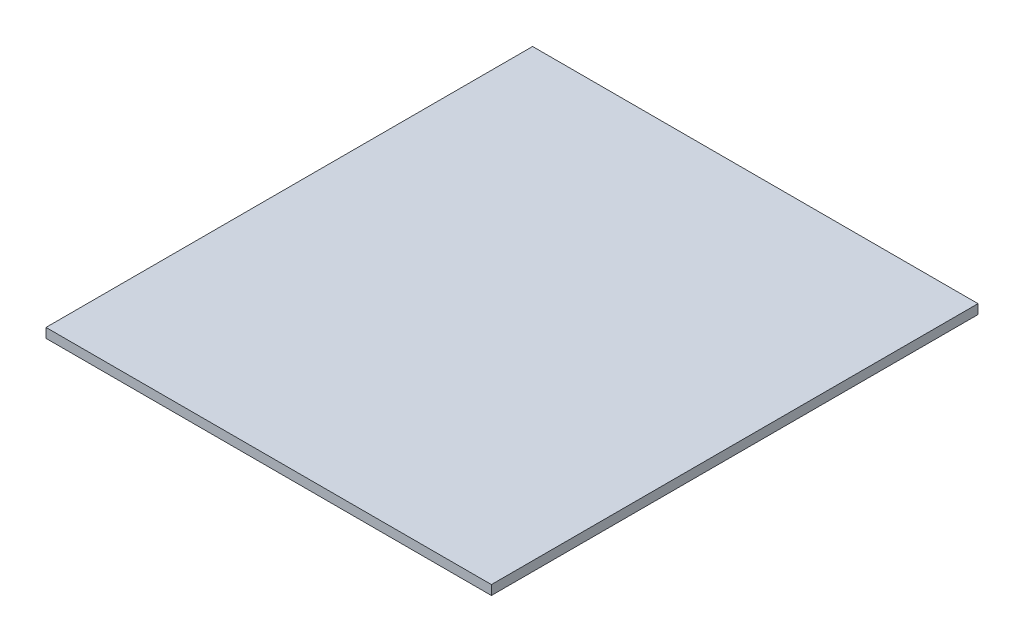
ISO-10303-21;
HEADER;
FILE_DESCRIPTION(('STEP AP214'),'2;1');
FILE_NAME('part.step','',(''),(''),'','','');
FILE_SCHEMA(('AUTOMOTIVE_DESIGN { 1 0 10303 214 1 1 1 1 }'));
ENDSEC;
DATA;
#1=APPLICATION_CONTEXT('core data for automotive mechanical design processes');
#2=APPLICATION_PROTOCOL_DEFINITION('international standard','automotive_design',2000,#1);
#3=PRODUCT_CONTEXT('',#1,'mechanical');
#4=PRODUCT('Part','Part','',(#3));
#5=PRODUCT_RELATED_PRODUCT_CATEGORY('part','',(#4));
#6=PRODUCT_DEFINITION_FORMATION('','',#4);
#7=PRODUCT_DEFINITION_CONTEXT('part definition',#1,'design');
#8=PRODUCT_DEFINITION('design','',#6,#7);
#9=PRODUCT_DEFINITION_SHAPE('','',#8);
#10=(LENGTH_UNIT() NAMED_UNIT(*) SI_UNIT(.MILLI.,.METRE.));
#11=(NAMED_UNIT(*) PLANE_ANGLE_UNIT() SI_UNIT($,.RADIAN.));
#12=(NAMED_UNIT(*) SI_UNIT($,.STERADIAN.) SOLID_ANGLE_UNIT());
#13=UNCERTAINTY_MEASURE_WITH_UNIT(LENGTH_MEASURE(1.E-05),#10,'distance_accuracy_value','');
#14=(GEOMETRIC_REPRESENTATION_CONTEXT(3) GLOBAL_UNCERTAINTY_ASSIGNED_CONTEXT((#13)) GLOBAL_UNIT_ASSIGNED_CONTEXT((#10,
#11,#12)) REPRESENTATION_CONTEXT('',''));
#15=CARTESIAN_POINT('',(0.,0.,0.));
#16=DIRECTION('',(0.,0.,1.));
#17=DIRECTION('',(1.,0.,0.));
#18=AXIS2_PLACEMENT_3D('',#15,#16,#17);
#19=CARTESIAN_POINT('',(0.,6.35,0.));
#20=DIRECTION('',(1.,0.,0.));
#21=DIRECTION('',(0.,0.,-1.));
#22=AXIS2_PLACEMENT_3D('',#19,#20,#21);
#23=PLANE('',#22);
#24=DIRECTION('',(0.,0.,1.));
#25=VECTOR('',#24,1.);
#26=CARTESIAN_POINT('',(0.,2.975,-152.4));
#27=LINE('',#26,#25);
#28=CARTESIAN_POINT('',(0.,2.975,-152.4));
#29=VERTEX_POINT('',#28);
#30=CARTESIAN_POINT('',(0.,2.975,0.));
#31=VERTEX_POINT('',#30);
#32=EDGE_CURVE('E75',#29,#31,#27,.T.);
#33=ORIENTED_EDGE('',*,*,#32,.F.);
#34=DIRECTION('',(0.,-1.,0.));
#35=VECTOR('',#34,1.);
#36=CARTESIAN_POINT('',(0.,6.35,-152.4));
#37=LINE('',#36,#35);
#38=CARTESIAN_POINT('',(0.,0.,-152.4));
#39=VERTEX_POINT('',#38);
#40=EDGE_CURVE('E59',#29,#39,#37,.T.);
#41=ORIENTED_EDGE('',*,*,#40,.T.);
#42=DIRECTION('',(0.,0.,1.));
#43=VECTOR('',#42,1.);
#44=CARTESIAN_POINT('',(0.,0.,0.));
#45=LINE('',#44,#43);
#46=CARTESIAN_POINT('',(0.,0.,0.));
#47=VERTEX_POINT('',#46);
#48=EDGE_CURVE('E89',#39,#47,#45,.T.);
#49=ORIENTED_EDGE('',*,*,#48,.T.);
#50=DIRECTION('',(0.,-1.,0.));
#51=VECTOR('',#50,1.);
#52=CARTESIAN_POINT('',(0.,6.35,0.));
#53=LINE('',#52,#51);
#54=EDGE_CURVE('E11',#31,#47,#53,.T.);
#55=ORIENTED_EDGE('',*,*,#54,.F.);
#56=EDGE_LOOP('',(#33,#41,#49,#55));
#57=FACE_BOUND('',#56,.T.);
#58=ADVANCED_FACE('F37',(#57),#23,.F.);
#59=CARTESIAN_POINT('',(0.,6.35,0.));
#60=DIRECTION('',(0.,0.,-1.));
#61=DIRECTION('',(-1.,0.,0.));
#62=AXIS2_PLACEMENT_3D('',#59,#60,#61);
#63=PLANE('',#62);
#64=DIRECTION('',(1.,0.,0.));
#65=VECTOR('',#64,1.);
#66=CARTESIAN_POINT('',(0.,2.975,0.));
#67=LINE('',#66,#65);
#68=CARTESIAN_POINT('',(139.5,2.975,0.));
#69=VERTEX_POINT('',#68);
#70=EDGE_CURVE('E78',#31,#69,#67,.T.);
#71=ORIENTED_EDGE('',*,*,#70,.F.);
#72=ORIENTED_EDGE('',*,*,#54,.T.);
#73=DIRECTION('',(1.,0.,0.));
#74=VECTOR('',#73,1.);
#75=CARTESIAN_POINT('',(0.,0.,0.));
#76=LINE('',#75,#74);
#77=CARTESIAN_POINT('',(139.5,0.,0.));
#78=VERTEX_POINT('',#77);
#79=EDGE_CURVE('E92',#47,#78,#76,.T.);
#80=ORIENTED_EDGE('',*,*,#79,.T.);
#81=DIRECTION('',(0.,-1.,0.));
#82=VECTOR('',#81,1.);
#83=CARTESIAN_POINT('',(139.5,6.35,0.));
#84=LINE('',#83,#82);
#85=EDGE_CURVE('E44',#69,#78,#84,.T.);
#86=ORIENTED_EDGE('',*,*,#85,.F.);
#87=EDGE_LOOP('',(#71,#72,#80,#86));
#88=FACE_BOUND('',#87,.T.);
#89=ADVANCED_FACE('F84',(#88),#63,.F.);
#90=CARTESIAN_POINT('',(139.5,6.35,0.));
#91=DIRECTION('',(-1.,0.,0.));
#92=DIRECTION('',(0.,0.,1.));
#93=AXIS2_PLACEMENT_3D('',#90,#91,#92);
#94=PLANE('',#93);
#95=DIRECTION('',(0.,0.,-1.));
#96=VECTOR('',#95,1.);
#97=CARTESIAN_POINT('',(139.5,2.975,-152.4));
#98=LINE('',#97,#96);
#99=CARTESIAN_POINT('',(139.5,2.975,-152.4));
#100=VERTEX_POINT('',#99);
#101=EDGE_CURVE('E51',#69,#100,#98,.T.);
#102=ORIENTED_EDGE('',*,*,#101,.F.);
#103=ORIENTED_EDGE('',*,*,#85,.T.);
#104=DIRECTION('',(0.,0.,-1.));
#105=VECTOR('',#104,1.);
#106=CARTESIAN_POINT('',(139.5,0.,0.));
#107=LINE('',#106,#105);
#108=CARTESIAN_POINT('',(139.5,0.,-152.4));
#109=VERTEX_POINT('',#108);
#110=EDGE_CURVE('E94',#78,#109,#107,.T.);
#111=ORIENTED_EDGE('',*,*,#110,.T.);
#112=DIRECTION('',(0.,-1.,0.));
#113=VECTOR('',#112,1.);
#114=CARTESIAN_POINT('',(139.5,6.35,-152.4));
#115=LINE('',#114,#113);
#116=EDGE_CURVE('E104',#100,#109,#115,.T.);
#117=ORIENTED_EDGE('',*,*,#116,.F.);
#118=EDGE_LOOP('',(#102,#103,#111,#117));
#119=FACE_BOUND('',#118,.T.);
#120=ADVANCED_FACE('F106',(#119),#94,.F.);
#121=CARTESIAN_POINT('',(0.,6.35,-152.4));
#122=DIRECTION('',(0.,0.,1.));
#123=DIRECTION('',(1.,0.,0.));
#124=AXIS2_PLACEMENT_3D('',#121,#122,#123);
#125=PLANE('',#124);
#126=DIRECTION('',(-1.,0.,0.));
#127=VECTOR('',#126,1.);
#128=CARTESIAN_POINT('',(0.,2.975,-152.4));
#129=LINE('',#128,#127);
#130=EDGE_CURVE('E79',#100,#29,#129,.T.);
#131=ORIENTED_EDGE('',*,*,#130,.F.);
#132=ORIENTED_EDGE('',*,*,#116,.T.);
#133=DIRECTION('',(-1.,0.,0.));
#134=VECTOR('',#133,1.);
#135=CARTESIAN_POINT('',(0.,0.,-152.4));
#136=LINE('',#135,#134);
#137=EDGE_CURVE('E101',#109,#39,#136,.T.);
#138=ORIENTED_EDGE('',*,*,#137,.T.);
#139=ORIENTED_EDGE('',*,*,#40,.F.);
#140=EDGE_LOOP('',(#131,#132,#138,#139));
#141=FACE_BOUND('',#140,.T.);
#142=ADVANCED_FACE('F111',(#141),#125,.F.);
#143=CARTESIAN_POINT('',(0.,0.,0.));
#144=DIRECTION('',(0.,-1.,0.));
#145=DIRECTION('',(0.,0.,-1.));
#146=AXIS2_PLACEMENT_3D('',#143,#144,#145);
#147=PLANE('',#146);
#148=ORIENTED_EDGE('',*,*,#48,.F.);
#149=ORIENTED_EDGE('',*,*,#137,.F.);
#150=ORIENTED_EDGE('',*,*,#110,.F.);
#151=ORIENTED_EDGE('',*,*,#79,.F.);
#152=EDGE_LOOP('',(#148,#149,#150,#151));
#153=FACE_BOUND('',#152,.T.);
#154=ADVANCED_FACE('F109',(#153),#147,.T.);
#155=CARTESIAN_POINT('',(0.,2.975,0.));
#156=DIRECTION('',(0.,1.,0.));
#157=DIRECTION('',(0.,0.,1.));
#158=AXIS2_PLACEMENT_3D('',#155,#156,#157);
#159=PLANE('',#158);
#160=ORIENTED_EDGE('',*,*,#32,.T.);
#161=ORIENTED_EDGE('',*,*,#70,.T.);
#162=ORIENTED_EDGE('',*,*,#101,.T.);
#163=ORIENTED_EDGE('',*,*,#130,.T.);
#164=EDGE_LOOP('',(#160,#161,#162,#163));
#165=FACE_BOUND('',#164,.T.);
#166=ADVANCED_FACE('F77',(#165),#159,.T.);
#167=CLOSED_SHELL('',(#58,#89,#120,#142,#154,#166));
#168=MANIFOLD_SOLID_BREP('B2',#167);
#169=ADVANCED_BREP_SHAPE_REPRESENTATION('',(#18,#168),#14);
#170=SHAPE_DEFINITION_REPRESENTATION(#9,#169);
ENDSEC;
END-ISO-10303-21;
